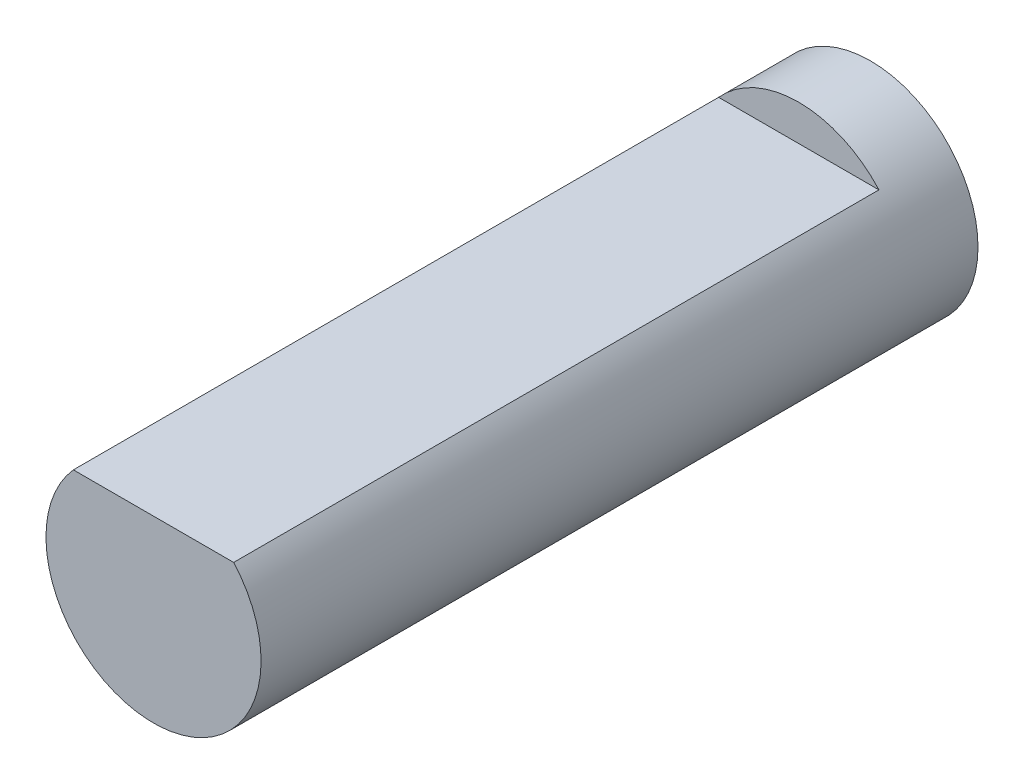
ISO-10303-21;
HEADER;
FILE_DESCRIPTION(('STEP AP214'),'2;1');
FILE_NAME('part.step','',(''),(''),'','','');
FILE_SCHEMA(('AUTOMOTIVE_DESIGN { 1 0 10303 214 1 1 1 1 }'));
ENDSEC;
DATA;
#1=APPLICATION_CONTEXT('core data for automotive mechanical design processes');
#2=APPLICATION_PROTOCOL_DEFINITION('international standard','automotive_design',2000,#1);
#3=PRODUCT_CONTEXT('',#1,'mechanical');
#4=PRODUCT('Part','Part','',(#3));
#5=PRODUCT_RELATED_PRODUCT_CATEGORY('part','',(#4));
#6=PRODUCT_DEFINITION_FORMATION('','',#4);
#7=PRODUCT_DEFINITION_CONTEXT('part definition',#1,'design');
#8=PRODUCT_DEFINITION('design','',#6,#7);
#9=PRODUCT_DEFINITION_SHAPE('','',#8);
#10=(LENGTH_UNIT() NAMED_UNIT(*) SI_UNIT(.MILLI.,.METRE.));
#11=(NAMED_UNIT(*) PLANE_ANGLE_UNIT() SI_UNIT($,.RADIAN.));
#12=(NAMED_UNIT(*) SI_UNIT($,.STERADIAN.) SOLID_ANGLE_UNIT());
#13=UNCERTAINTY_MEASURE_WITH_UNIT(LENGTH_MEASURE(1.E-05),#10,'distance_accuracy_value','');
#14=(GEOMETRIC_REPRESENTATION_CONTEXT(3) GLOBAL_UNCERTAINTY_ASSIGNED_CONTEXT((#13)) GLOBAL_UNIT_ASSIGNED_CONTEXT((#10,
#11,#12)) REPRESENTATION_CONTEXT('',''));
#15=CARTESIAN_POINT('',(0.,0.,0.));
#16=DIRECTION('',(0.,0.,1.));
#17=DIRECTION('',(1.,0.,0.));
#18=AXIS2_PLACEMENT_3D('',#15,#16,#17);
#19=CARTESIAN_POINT('',(0.,0.,10.));
#20=DIRECTION('',(0.,0.,-1.));
#21=DIRECTION('',(-1.,0.,0.));
#22=AXIS2_PLACEMENT_3D('',#19,#20,#21);
#23=CYLINDRICAL_SURFACE('',#22,1.5);
#24=CARTESIAN_POINT('',(0.,0.,10.));
#25=DIRECTION('',(0.,0.,1.));
#26=DIRECTION('',(1.,0.,0.));
#27=AXIS2_PLACEMENT_3D('',#24,#25,#26);
#28=CIRCLE('',#27,1.5);
#29=CARTESIAN_POINT('',(-1.1180339887499,1.,10.));
#30=VERTEX_POINT('',#29);
#31=CARTESIAN_POINT('',(1.1180339887499,1.,10.));
#32=VERTEX_POINT('',#31);
#33=EDGE_CURVE('E11',#30,#32,#28,.T.);
#34=ORIENTED_EDGE('',*,*,#33,.F.);
#35=DIRECTION('',(0.,0.,1.));
#36=VECTOR('',#35,1.);
#37=CARTESIAN_POINT('',(-1.1180339887499,1.,1.));
#38=LINE('',#37,#36);
#39=CARTESIAN_POINT('',(-1.1180339887499,1.,1.));
#40=VERTEX_POINT('',#39);
#41=EDGE_CURVE('E51',#40,#30,#38,.T.);
#42=ORIENTED_EDGE('',*,*,#41,.F.);
#43=CARTESIAN_POINT('',(0.,0.,1.));
#44=DIRECTION('',(0.,0.,1.));
#45=DIRECTION('',(-1.,0.,0.));
#46=AXIS2_PLACEMENT_3D('',#43,#44,#45);
#47=CIRCLE('',#46,1.5);
#48=CARTESIAN_POINT('',(1.1180339887499,1.,1.));
#49=VERTEX_POINT('',#48);
#50=EDGE_CURVE('E66',#49,#40,#47,.T.);
#51=ORIENTED_EDGE('',*,*,#50,.F.);
#52=DIRECTION('',(0.,0.,1.));
#53=VECTOR('',#52,1.);
#54=CARTESIAN_POINT('',(1.1180339887499,1.,1.));
#55=LINE('',#54,#53);
#56=EDGE_CURVE('E57',#49,#32,#55,.T.);
#57=ORIENTED_EDGE('',*,*,#56,.T.);
#58=EDGE_LOOP('',(#34,#42,#51,#57));
#59=FACE_BOUND('',#58,.T.);
#60=CARTESIAN_POINT('',(0.,0.,0.));
#61=DIRECTION('',(0.,0.,1.));
#62=DIRECTION('',(1.,0.,0.));
#63=AXIS2_PLACEMENT_3D('',#60,#61,#62);
#64=CIRCLE('',#63,1.5);
#65=CARTESIAN_POINT('',(1.5,0.,0.));
#66=VERTEX_POINT('',#65);
#67=EDGE_CURVE('E40',#66,#66,#64,.T.);
#68=ORIENTED_EDGE('',*,*,#67,.T.);
#69=EDGE_LOOP('',(#68));
#70=FACE_BOUND('',#69,.T.);
#71=ADVANCED_FACE('F37',(#59,#70),#23,.T.);
#72=CARTESIAN_POINT('',(0.,0.,10.));
#73=DIRECTION('',(0.,0.,1.));
#74=DIRECTION('',(1.,0.,0.));
#75=AXIS2_PLACEMENT_3D('',#72,#73,#74);
#76=PLANE('',#75);
#77=DIRECTION('',(1.,0.,0.));
#78=VECTOR('',#77,1.);
#79=CARTESIAN_POINT('',(-1.1180339887499,1.,10.));
#80=LINE('',#79,#78);
#81=EDGE_CURVE('E62',#30,#32,#80,.T.);
#82=ORIENTED_EDGE('',*,*,#81,.F.);
#83=ORIENTED_EDGE('',*,*,#33,.T.);
#84=EDGE_LOOP('',(#82,#83));
#85=FACE_BOUND('',#84,.T.);
#86=ADVANCED_FACE('F72',(#85),#76,.T.);
#87=CARTESIAN_POINT('',(0.,0.,0.));
#88=DIRECTION('',(0.,0.,1.));
#89=DIRECTION('',(1.,0.,0.));
#90=AXIS2_PLACEMENT_3D('',#87,#88,#89);
#91=PLANE('',#90);
#92=ORIENTED_EDGE('',*,*,#67,.F.);
#93=EDGE_LOOP('',(#92));
#94=FACE_BOUND('',#93,.T.);
#95=ADVANCED_FACE('F74',(#94),#91,.F.);
#96=CARTESIAN_POINT('',(-1.1180339887499,1.,1.));
#97=DIRECTION('',(0.,-1.,0.));
#98=DIRECTION('',(0.,0.,-1.));
#99=AXIS2_PLACEMENT_3D('',#96,#97,#98);
#100=PLANE('',#99);
#101=ORIENTED_EDGE('',*,*,#81,.T.);
#102=ORIENTED_EDGE('',*,*,#56,.F.);
#103=DIRECTION('',(1.,0.,0.));
#104=VECTOR('',#103,1.);
#105=CARTESIAN_POINT('',(-1.1180339887499,1.,1.));
#106=LINE('',#105,#104);
#107=EDGE_CURVE('E89',#40,#49,#106,.T.);
#108=ORIENTED_EDGE('',*,*,#107,.F.);
#109=ORIENTED_EDGE('',*,*,#41,.T.);
#110=EDGE_LOOP('',(#101,#102,#108,#109));
#111=FACE_BOUND('',#110,.T.);
#112=ADVANCED_FACE('F63',(#111),#100,.F.);
#113=CARTESIAN_POINT('',(0.,0.,1.));
#114=DIRECTION('',(0.,0.,-1.));
#115=DIRECTION('',(-1.,0.,0.));
#116=AXIS2_PLACEMENT_3D('',#113,#114,#115);
#117=PLANE('',#116);
#118=ORIENTED_EDGE('',*,*,#50,.T.);
#119=ORIENTED_EDGE('',*,*,#107,.T.);
#120=EDGE_LOOP('',(#118,#119));
#121=FACE_BOUND('',#120,.T.);
#122=ADVANCED_FACE('F84',(#121),#117,.F.);
#123=CLOSED_SHELL('',(#71,#86,#95,#112,#122));
#124=MANIFOLD_SOLID_BREP('B2',#123);
#125=ADVANCED_BREP_SHAPE_REPRESENTATION('',(#18,#124),#14);
#126=SHAPE_DEFINITION_REPRESENTATION(#9,#125);
ENDSEC;
END-ISO-10303-21;
